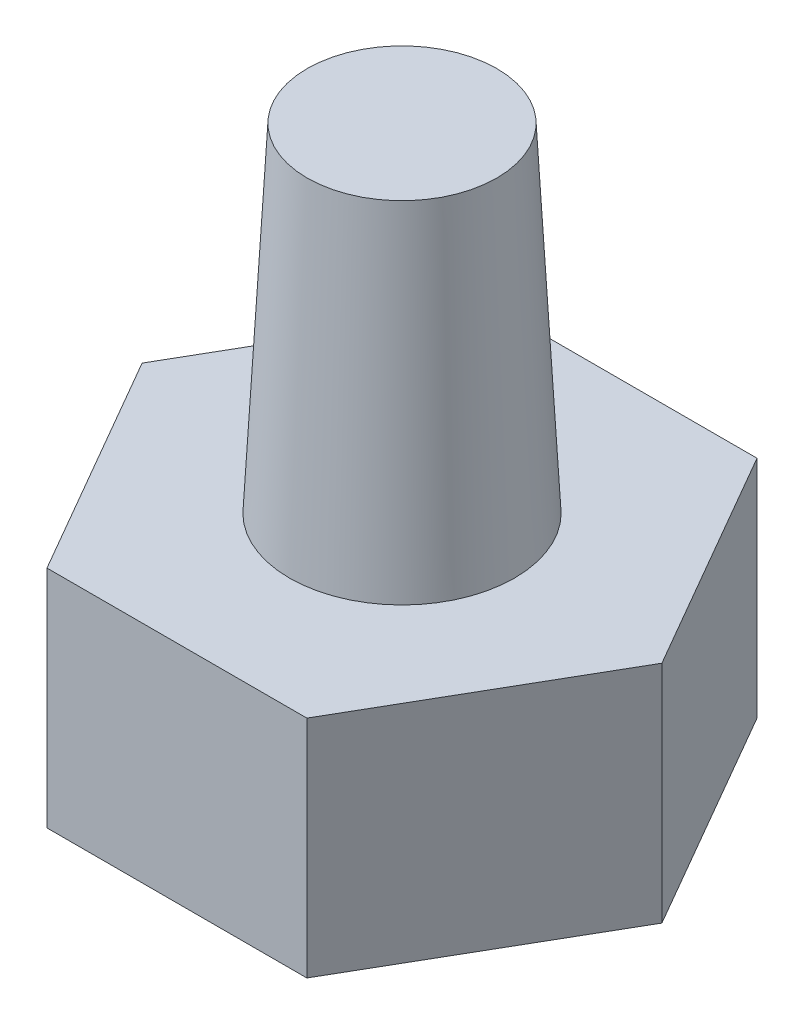
ISO-10303-21;
HEADER;
FILE_DESCRIPTION(('STEP AP214'),'2;1');
FILE_NAME('part.step','',(''),(''),'','','');
FILE_SCHEMA(('AUTOMOTIVE_DESIGN { 1 0 10303 214 1 1 1 1 }'));
ENDSEC;
DATA;
#1=APPLICATION_CONTEXT('core data for automotive mechanical design processes');
#2=APPLICATION_PROTOCOL_DEFINITION('international standard','automotive_design',2000,#1);
#3=PRODUCT_CONTEXT('',#1,'mechanical');
#4=PRODUCT('Part','Part','',(#3));
#5=PRODUCT_RELATED_PRODUCT_CATEGORY('part','',(#4));
#6=PRODUCT_DEFINITION_FORMATION('','',#4);
#7=PRODUCT_DEFINITION_CONTEXT('part definition',#1,'design');
#8=PRODUCT_DEFINITION('design','',#6,#7);
#9=PRODUCT_DEFINITION_SHAPE('','',#8);
#10=(LENGTH_UNIT() NAMED_UNIT(*) SI_UNIT(.MILLI.,.METRE.));
#11=(NAMED_UNIT(*) PLANE_ANGLE_UNIT() SI_UNIT($,.RADIAN.));
#12=(NAMED_UNIT(*) SI_UNIT($,.STERADIAN.) SOLID_ANGLE_UNIT());
#13=UNCERTAINTY_MEASURE_WITH_UNIT(LENGTH_MEASURE(1.E-05),#10,'distance_accuracy_value','');
#14=(GEOMETRIC_REPRESENTATION_CONTEXT(3) GLOBAL_UNCERTAINTY_ASSIGNED_CONTEXT((#13)) GLOBAL_UNIT_ASSIGNED_CONTEXT((#10,
#11,#12)) REPRESENTATION_CONTEXT('',''));
#15=CARTESIAN_POINT('',(0.,0.,0.));
#16=DIRECTION('',(0.,0.,1.));
#17=DIRECTION('',(1.,0.,0.));
#18=AXIS2_PLACEMENT_3D('',#15,#16,#17);
#19=CARTESIAN_POINT('',(6.92820323027564,12.,11.9999999999999));
#20=DIRECTION('',(-0.866025403784441,0.,-0.499999999999995));
#21=DIRECTION('',(-0.499999999999995,0.,0.866025403784442));
#22=AXIS2_PLACEMENT_3D('',#19,#20,#21);
#23=PLANE('',#22);
#24=DIRECTION('',(0.499999999999995,0.,-0.866025403784442));
#25=VECTOR('',#24,1.);
#26=CARTESIAN_POINT('',(6.92820323027564,0.,11.9999999999999));
#27=LINE('',#26,#25);
#28=CARTESIAN_POINT('',(6.92820323027564,0.,11.9999999999999));
#29=VERTEX_POINT('',#28);
#30=CARTESIAN_POINT('',(13.856406460551,0.,0.));
#31=VERTEX_POINT('',#30);
#32=EDGE_CURVE('E116',#29,#31,#27,.T.);
#33=ORIENTED_EDGE('',*,*,#32,.T.);
#34=DIRECTION('',(0.,-1.,0.));
#35=VECTOR('',#34,1.);
#36=CARTESIAN_POINT('',(13.856406460551,12.,0.));
#37=LINE('',#36,#35);
#38=CARTESIAN_POINT('',(13.856406460551,12.,0.));
#39=VERTEX_POINT('',#38);
#40=EDGE_CURVE('E11',#39,#31,#37,.T.);
#41=ORIENTED_EDGE('',*,*,#40,.F.);
#42=DIRECTION('',(0.499999999999995,0.,-0.866025403784442));
#43=VECTOR('',#42,1.);
#44=CARTESIAN_POINT('',(6.92820323027564,12.,11.9999999999999));
#45=LINE('',#44,#43);
#46=CARTESIAN_POINT('',(6.92820323027564,12.,11.9999999999999));
#47=VERTEX_POINT('',#46);
#48=EDGE_CURVE('E127',#47,#39,#45,.T.);
#49=ORIENTED_EDGE('',*,*,#48,.F.);
#50=DIRECTION('',(0.,-1.,0.));
#51=VECTOR('',#50,1.);
#52=CARTESIAN_POINT('',(6.92820323027564,12.,11.9999999999999));
#53=LINE('',#52,#51);
#54=EDGE_CURVE('E112',#47,#29,#53,.T.);
#55=ORIENTED_EDGE('',*,*,#54,.T.);
#56=EDGE_LOOP('',(#33,#41,#49,#55));
#57=FACE_BOUND('',#56,.T.);
#58=ADVANCED_FACE('F32',(#57),#23,.F.);
#59=CARTESIAN_POINT('',(13.856406460551,12.,0.));
#60=DIRECTION('',(-0.866025403784438,0.,0.500000000000001));
#61=DIRECTION('',(0.500000000000001,0.,0.866025403784438));
#62=AXIS2_PLACEMENT_3D('',#59,#60,#61);
#63=PLANE('',#62);
#64=DIRECTION('',(-0.500000000000001,0.,-0.866025403784438));
#65=VECTOR('',#64,1.);
#66=CARTESIAN_POINT('',(13.856406460551,0.,0.));
#67=LINE('',#66,#65);
#68=CARTESIAN_POINT('',(6.92820323027547,0.,-12.));
#69=VERTEX_POINT('',#68);
#70=EDGE_CURVE('E119',#31,#69,#67,.T.);
#71=ORIENTED_EDGE('',*,*,#70,.T.);
#72=DIRECTION('',(0.,-1.,0.));
#73=VECTOR('',#72,1.);
#74=CARTESIAN_POINT('',(6.92820323027547,12.,-12.));
#75=LINE('',#74,#73);
#76=CARTESIAN_POINT('',(6.92820323027547,12.,-12.));
#77=VERTEX_POINT('',#76);
#78=EDGE_CURVE('E40',#77,#69,#75,.T.);
#79=ORIENTED_EDGE('',*,*,#78,.F.);
#80=DIRECTION('',(-0.500000000000001,0.,-0.866025403784438));
#81=VECTOR('',#80,1.);
#82=CARTESIAN_POINT('',(13.856406460551,12.,0.));
#83=LINE('',#82,#81);
#84=EDGE_CURVE('E85',#39,#77,#83,.T.);
#85=ORIENTED_EDGE('',*,*,#84,.F.);
#86=ORIENTED_EDGE('',*,*,#40,.T.);
#87=EDGE_LOOP('',(#71,#79,#85,#86));
#88=FACE_BOUND('',#87,.T.);
#89=ADVANCED_FACE('F152',(#88),#63,.F.);
#90=CARTESIAN_POINT('',(6.92820323027547,12.,-12.));
#91=DIRECTION('',(0.,0.,1.));
#92=DIRECTION('',(1.,0.,0.));
#93=AXIS2_PLACEMENT_3D('',#90,#91,#92);
#94=PLANE('',#93);
#95=DIRECTION('',(-1.,0.,0.));
#96=VECTOR('',#95,1.);
#97=CARTESIAN_POINT('',(6.92820323027547,0.,-12.));
#98=LINE('',#97,#96);
#99=CARTESIAN_POINT('',(-6.92820323027556,0.,-12.));
#100=VERTEX_POINT('',#99);
#101=EDGE_CURVE('E122',#69,#100,#98,.T.);
#102=ORIENTED_EDGE('',*,*,#101,.T.);
#103=DIRECTION('',(0.,-1.,0.));
#104=VECTOR('',#103,1.);
#105=CARTESIAN_POINT('',(-6.92820323027556,12.,-12.));
#106=LINE('',#105,#104);
#107=CARTESIAN_POINT('',(-6.92820323027556,12.,-12.));
#108=VERTEX_POINT('',#107);
#109=EDGE_CURVE('E107',#108,#100,#106,.T.);
#110=ORIENTED_EDGE('',*,*,#109,.F.);
#111=DIRECTION('',(-1.,0.,0.));
#112=VECTOR('',#111,1.);
#113=CARTESIAN_POINT('',(6.92820323027547,12.,-12.));
#114=LINE('',#113,#112);
#115=EDGE_CURVE('E98',#77,#108,#114,.T.);
#116=ORIENTED_EDGE('',*,*,#115,.F.);
#117=ORIENTED_EDGE('',*,*,#78,.T.);
#118=EDGE_LOOP('',(#102,#110,#116,#117));
#119=FACE_BOUND('',#118,.T.);
#120=ADVANCED_FACE('F133',(#119),#94,.F.);
#121=CARTESIAN_POINT('',(-6.92820323027556,12.,-12.));
#122=DIRECTION('',(0.866025403784441,0.,0.499999999999995));
#123=DIRECTION('',(0.499999999999995,0.,-0.866025403784442));
#124=AXIS2_PLACEMENT_3D('',#121,#122,#123);
#125=PLANE('',#124);
#126=DIRECTION('',(-0.499999999999995,0.,0.866025403784442));
#127=VECTOR('',#126,1.);
#128=CARTESIAN_POINT('',(-6.92820323027556,0.,-12.));
#129=LINE('',#128,#127);
#130=CARTESIAN_POINT('',(-13.856406460551,0.,0.));
#131=VERTEX_POINT('',#130);
#132=EDGE_CURVE('E106',#100,#131,#129,.T.);
#133=ORIENTED_EDGE('',*,*,#132,.T.);
#134=DIRECTION('',(0.,-1.,0.));
#135=VECTOR('',#134,1.);
#136=CARTESIAN_POINT('',(-13.856406460551,12.,0.));
#137=LINE('',#136,#135);
#138=CARTESIAN_POINT('',(-13.856406460551,12.,0.));
#139=VERTEX_POINT('',#138);
#140=EDGE_CURVE('E103',#139,#131,#137,.T.);
#141=ORIENTED_EDGE('',*,*,#140,.F.);
#142=DIRECTION('',(-0.499999999999995,0.,0.866025403784442));
#143=VECTOR('',#142,1.);
#144=CARTESIAN_POINT('',(-6.92820323027556,12.,-12.));
#145=LINE('',#144,#143);
#146=EDGE_CURVE('E92',#108,#139,#145,.T.);
#147=ORIENTED_EDGE('',*,*,#146,.F.);
#148=ORIENTED_EDGE('',*,*,#109,.T.);
#149=EDGE_LOOP('',(#133,#141,#147,#148));
#150=FACE_BOUND('',#149,.T.);
#151=ADVANCED_FACE('F104',(#150),#125,.F.);
#152=CARTESIAN_POINT('',(-13.856406460551,12.,0.));
#153=DIRECTION('',(0.866025403784434,0.,-0.500000000000007));
#154=DIRECTION('',(-0.500000000000007,0.,-0.866025403784435));
#155=AXIS2_PLACEMENT_3D('',#152,#153,#154);
#156=PLANE('',#155);
#157=DIRECTION('',(0.500000000000007,0.,0.866025403784435));
#158=VECTOR('',#157,1.);
#159=CARTESIAN_POINT('',(-13.856406460551,0.,0.));
#160=LINE('',#159,#158);
#161=CARTESIAN_POINT('',(-6.92820323027539,0.,12.));
#162=VERTEX_POINT('',#161);
#163=EDGE_CURVE('E71',#131,#162,#160,.T.);
#164=ORIENTED_EDGE('',*,*,#163,.T.);
#165=DIRECTION('',(0.,-1.,0.));
#166=VECTOR('',#165,1.);
#167=CARTESIAN_POINT('',(-6.92820323027539,12.,12.));
#168=LINE('',#167,#166);
#169=CARTESIAN_POINT('',(-6.92820323027539,12.,12.));
#170=VERTEX_POINT('',#169);
#171=EDGE_CURVE('E108',#170,#162,#168,.T.);
#172=ORIENTED_EDGE('',*,*,#171,.F.);
#173=DIRECTION('',(0.500000000000007,0.,0.866025403784435));
#174=VECTOR('',#173,1.);
#175=CARTESIAN_POINT('',(-13.856406460551,12.,0.));
#176=LINE('',#175,#174);
#177=EDGE_CURVE('E96',#139,#170,#176,.T.);
#178=ORIENTED_EDGE('',*,*,#177,.F.);
#179=ORIENTED_EDGE('',*,*,#140,.T.);
#180=EDGE_LOOP('',(#164,#172,#178,#179));
#181=FACE_BOUND('',#180,.T.);
#182=ADVANCED_FACE('F110',(#181),#156,.F.);
#183=CARTESIAN_POINT('',(-6.92820323027539,12.,12.));
#184=DIRECTION('',(0.,0.,-1.));
#185=DIRECTION('',(-1.,0.,0.));
#186=AXIS2_PLACEMENT_3D('',#183,#184,#185);
#187=PLANE('',#186);
#188=DIRECTION('',(1.,0.,0.));
#189=VECTOR('',#188,1.);
#190=CARTESIAN_POINT('',(-6.92820323027539,0.,12.));
#191=LINE('',#190,#189);
#192=EDGE_CURVE('E77',#162,#29,#191,.T.);
#193=ORIENTED_EDGE('',*,*,#192,.T.);
#194=ORIENTED_EDGE('',*,*,#54,.F.);
#195=DIRECTION('',(1.,0.,0.));
#196=VECTOR('',#195,1.);
#197=CARTESIAN_POINT('',(-6.92820323027539,12.,12.));
#198=LINE('',#197,#196);
#199=EDGE_CURVE('E48',#170,#47,#198,.T.);
#200=ORIENTED_EDGE('',*,*,#199,.F.);
#201=ORIENTED_EDGE('',*,*,#171,.T.);
#202=EDGE_LOOP('',(#193,#194,#200,#201));
#203=FACE_BOUND('',#202,.T.);
#204=ADVANCED_FACE('F140',(#203),#187,.F.);
#205=CARTESIAN_POINT('',(0.,12.,0.));
#206=DIRECTION('',(0.,1.,0.));
#207=DIRECTION('',(0.,0.,1.));
#208=AXIS2_PLACEMENT_3D('',#205,#206,#207);
#209=PLANE('',#208);
#210=CARTESIAN_POINT('',(0.,12.,0.));
#211=DIRECTION('',(0.,1.,0.));
#212=DIRECTION('',(0.,0.,1.));
#213=AXIS2_PLACEMENT_3D('',#210,#211,#212);
#214=CIRCLE('',#213,6.);
#215=CARTESIAN_POINT('',(0.,12.,6.));
#216=VERTEX_POINT('',#215);
#217=EDGE_CURVE('E235',#216,#216,#214,.T.);
#218=ORIENTED_EDGE('',*,*,#217,.F.);
#219=EDGE_LOOP('',(#218));
#220=FACE_BOUND('',#219,.T.);
#221=ORIENTED_EDGE('',*,*,#48,.T.);
#222=ORIENTED_EDGE('',*,*,#84,.T.);
#223=ORIENTED_EDGE('',*,*,#115,.T.);
#224=ORIENTED_EDGE('',*,*,#146,.T.);
#225=ORIENTED_EDGE('',*,*,#177,.T.);
#226=ORIENTED_EDGE('',*,*,#199,.T.);
#227=EDGE_LOOP('',(#221,#222,#223,#224,#225,#226));
#228=FACE_BOUND('',#227,.T.);
#229=ADVANCED_FACE('F94',(#220,#228),#209,.T.);
#230=CARTESIAN_POINT('',(0.,0.,0.));
#231=DIRECTION('',(0.,1.,0.));
#232=DIRECTION('',(0.,0.,1.));
#233=AXIS2_PLACEMENT_3D('',#230,#231,#232);
#234=PLANE('',#233);
#235=CARTESIAN_POINT('',(0.,0.,0.));
#236=DIRECTION('',(0.,1.,0.));
#237=DIRECTION('',(0.,0.,1.));
#238=AXIS2_PLACEMENT_3D('',#235,#236,#237);
#239=CIRCLE('',#238,10.);
#240=CARTESIAN_POINT('',(0.,0.,10.));
#241=VERTEX_POINT('',#240);
#242=EDGE_CURVE('E236',#241,#241,#239,.T.);
#243=ORIENTED_EDGE('',*,*,#242,.T.);
#244=EDGE_LOOP('',(#243));
#245=FACE_BOUND('',#244,.T.);
#246=ORIENTED_EDGE('',*,*,#32,.F.);
#247=ORIENTED_EDGE('',*,*,#192,.F.);
#248=ORIENTED_EDGE('',*,*,#163,.F.);
#249=ORIENTED_EDGE('',*,*,#132,.F.);
#250=ORIENTED_EDGE('',*,*,#101,.F.);
#251=ORIENTED_EDGE('',*,*,#70,.F.);
#252=EDGE_LOOP('',(#246,#247,#248,#249,#250,#251));
#253=FACE_BOUND('',#252,.T.);
#254=ADVANCED_FACE('F136',(#245,#253),#234,.F.);
#255=CARTESIAN_POINT('',(0.,12.,0.));
#256=DIRECTION('',(0.,-1.,0.));
#257=DIRECTION('',(0.,0.,1.));
#258=AXIS2_PLACEMENT_3D('',#255,#256,#257);
#259=CONICAL_SURFACE('',#258,6.,0.0523598775598299);
#260=CARTESIAN_POINT('',(0.,30.,0.));
#261=DIRECTION('',(0.,1.,0.));
#262=DIRECTION('',(0.,0.,1.));
#263=AXIS2_PLACEMENT_3D('',#260,#261,#262);
#264=CIRCLE('',#263,5.05665997290526);
#265=CARTESIAN_POINT('',(0.,30.,5.05665997290526));
#266=VERTEX_POINT('',#265);
#267=EDGE_CURVE('E120',#266,#266,#264,.T.);
#268=ORIENTED_EDGE('',*,*,#267,.F.);
#269=EDGE_LOOP('',(#268));
#270=FACE_BOUND('',#269,.T.);
#271=ORIENTED_EDGE('',*,*,#217,.T.);
#272=EDGE_LOOP('',(#271));
#273=FACE_BOUND('',#272,.T.);
#274=ADVANCED_FACE('F187',(#270,#273),#259,.T.);
#275=CARTESIAN_POINT('',(0.,30.,0.));
#276=DIRECTION('',(0.,1.,0.));
#277=DIRECTION('',(0.,0.,1.));
#278=AXIS2_PLACEMENT_3D('',#275,#276,#277);
#279=PLANE('',#278);
#280=ORIENTED_EDGE('',*,*,#267,.T.);
#281=EDGE_LOOP('',(#280));
#282=FACE_BOUND('',#281,.T.);
#283=ADVANCED_FACE('F192',(#282),#279,.T.);
#284=CARTESIAN_POINT('',(0.,10.,0.));
#285=DIRECTION('',(0.,-1.,0.));
#286=DIRECTION('',(0.,0.,-1.));
#287=AXIS2_PLACEMENT_3D('',#284,#285,#286);
#288=CYLINDRICAL_SURFACE('',#287,10.);
#289=CARTESIAN_POINT('',(0.,10.,0.));
#290=DIRECTION('',(0.,1.,0.));
#291=DIRECTION('',(0.,0.,1.));
#292=AXIS2_PLACEMENT_3D('',#289,#290,#291);
#293=CIRCLE('',#292,10.);
#294=CARTESIAN_POINT('',(0.,10.,10.));
#295=VERTEX_POINT('',#294);
#296=EDGE_CURVE('E234',#295,#295,#293,.T.);
#297=ORIENTED_EDGE('',*,*,#296,.T.);
#298=EDGE_LOOP('',(#297));
#299=FACE_BOUND('',#298,.T.);
#300=ORIENTED_EDGE('',*,*,#242,.F.);
#301=EDGE_LOOP('',(#300));
#302=FACE_BOUND('',#301,.T.);
#303=ADVANCED_FACE('F202',(#299,#302),#288,.F.);
#304=CARTESIAN_POINT('',(0.,10.,0.));
#305=DIRECTION('',(0.,1.,0.));
#306=DIRECTION('',(0.,0.,1.));
#307=AXIS2_PLACEMENT_3D('',#304,#305,#306);
#308=PLANE('',#307);
#309=ORIENTED_EDGE('',*,*,#296,.F.);
#310=EDGE_LOOP('',(#309));
#311=FACE_BOUND('',#310,.T.);
#312=ADVANCED_FACE('F218',(#311),#308,.F.);
#313=CLOSED_SHELL('',(#58,#89,#120,#151,#182,#204,#229,#254,#274,#283,#303,#312));
#314=MANIFOLD_SOLID_BREP('B2',#313);
#315=ADVANCED_BREP_SHAPE_REPRESENTATION('',(#18,#314),#14);
#316=SHAPE_DEFINITION_REPRESENTATION(#9,#315);
ENDSEC;
END-ISO-10303-21;
